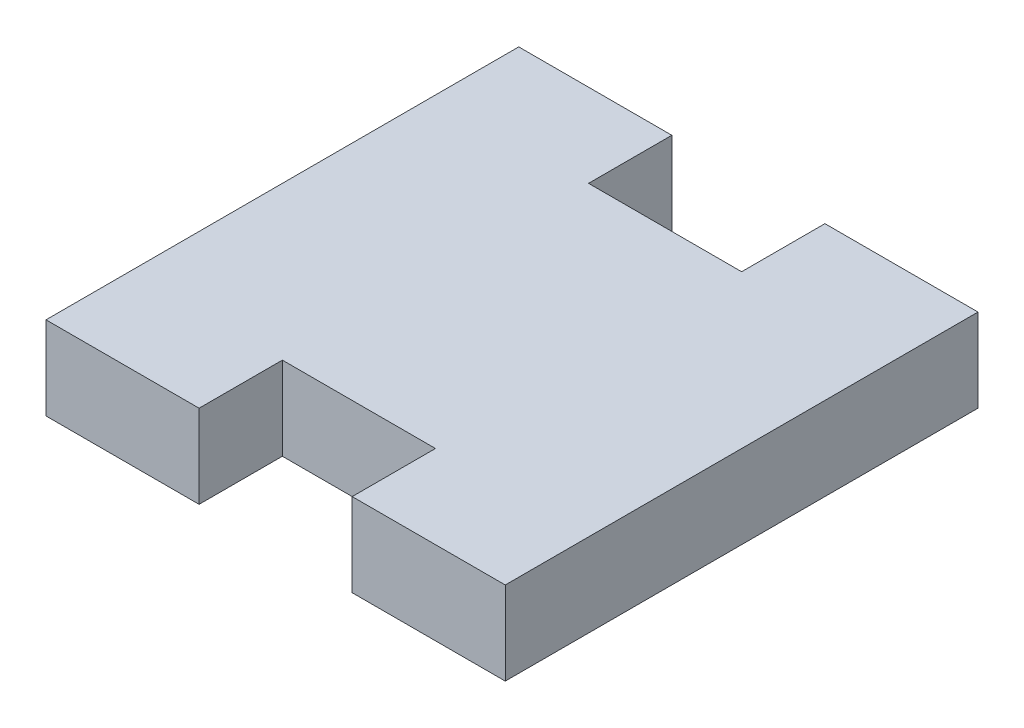
ISO-10303-21;
HEADER;
FILE_DESCRIPTION(('STEP AP214'),'2;1');
FILE_NAME('part.step','',(''),(''),'','','');
FILE_SCHEMA(('AUTOMOTIVE_DESIGN { 1 0 10303 214 1 1 1 1 }'));
ENDSEC;
DATA;
#1=APPLICATION_CONTEXT('core data for automotive mechanical design processes');
#2=APPLICATION_PROTOCOL_DEFINITION('international standard','automotive_design',2000,#1);
#3=PRODUCT_CONTEXT('',#1,'mechanical');
#4=PRODUCT('Part','Part','',(#3));
#5=PRODUCT_RELATED_PRODUCT_CATEGORY('part','',(#4));
#6=PRODUCT_DEFINITION_FORMATION('','',#4);
#7=PRODUCT_DEFINITION_CONTEXT('part definition',#1,'design');
#8=PRODUCT_DEFINITION('design','',#6,#7);
#9=PRODUCT_DEFINITION_SHAPE('','',#8);
#10=(LENGTH_UNIT() NAMED_UNIT(*) SI_UNIT(.MILLI.,.METRE.));
#11=(NAMED_UNIT(*) PLANE_ANGLE_UNIT() SI_UNIT($,.RADIAN.));
#12=(NAMED_UNIT(*) SI_UNIT($,.STERADIAN.) SOLID_ANGLE_UNIT());
#13=UNCERTAINTY_MEASURE_WITH_UNIT(LENGTH_MEASURE(1.E-05),#10,'distance_accuracy_value','');
#14=(GEOMETRIC_REPRESENTATION_CONTEXT(3) GLOBAL_UNCERTAINTY_ASSIGNED_CONTEXT((#13)) GLOBAL_UNIT_ASSIGNED_CONTEXT((#10,
#11,#12)) REPRESENTATION_CONTEXT('',''));
#15=CARTESIAN_POINT('',(0.,0.,0.));
#16=DIRECTION('',(0.,0.,1.));
#17=DIRECTION('',(1.,0.,0.));
#18=AXIS2_PLACEMENT_3D('',#15,#16,#17);
#19=CARTESIAN_POINT('',(0.,5.44,-30.88));
#20=DIRECTION('',(0.,-1.,0.));
#21=DIRECTION('',(0.,0.,-1.));
#22=AXIS2_PLACEMENT_3D('',#19,#20,#21);
#23=PLANE('',#22);
#24=DIRECTION('',(0.,0.,-1.));
#25=VECTOR('',#24,1.);
#26=CARTESIAN_POINT('',(20.,5.44,0.));
#27=LINE('',#26,#25);
#28=CARTESIAN_POINT('',(20.,5.44,0.));
#29=VERTEX_POINT('',#28);
#30=CARTESIAN_POINT('',(20.,5.44,-5.44));
#31=VERTEX_POINT('',#30);
#32=EDGE_CURVE('E132',#29,#31,#27,.T.);
#33=ORIENTED_EDGE('',*,*,#32,.F.);
#34=DIRECTION('',(1.,0.,0.));
#35=VECTOR('',#34,1.);
#36=CARTESIAN_POINT('',(0.,5.44,0.));
#37=LINE('',#36,#35);
#38=CARTESIAN_POINT('',(30.,5.44,0.));
#39=VERTEX_POINT('',#38);
#40=EDGE_CURVE('E140',#29,#39,#37,.T.);
#41=ORIENTED_EDGE('',*,*,#40,.T.);
#42=DIRECTION('',(0.,0.,-1.));
#43=VECTOR('',#42,1.);
#44=CARTESIAN_POINT('',(30.,5.44,0.));
#45=LINE('',#44,#43);
#46=CARTESIAN_POINT('',(30.,5.44,-30.88));
#47=VERTEX_POINT('',#46);
#48=EDGE_CURVE('E200',#39,#47,#45,.T.);
#49=ORIENTED_EDGE('',*,*,#48,.T.);
#50=DIRECTION('',(-1.,0.,0.));
#51=VECTOR('',#50,1.);
#52=CARTESIAN_POINT('',(0.,5.44,-30.88));
#53=LINE('',#52,#51);
#54=CARTESIAN_POINT('',(20.,5.44,-30.88));
#55=VERTEX_POINT('',#54);
#56=EDGE_CURVE('E166',#47,#55,#53,.T.);
#57=ORIENTED_EDGE('',*,*,#56,.T.);
#58=DIRECTION('',(0.,0.,1.));
#59=VECTOR('',#58,1.);
#60=CARTESIAN_POINT('',(20.,5.44,-30.88));
#61=LINE('',#60,#59);
#62=CARTESIAN_POINT('',(20.,5.44,-25.44));
#63=VERTEX_POINT('',#62);
#64=EDGE_CURVE('E191',#55,#63,#61,.T.);
#65=ORIENTED_EDGE('',*,*,#64,.T.);
#66=DIRECTION('',(1.,0.,0.));
#67=VECTOR('',#66,1.);
#68=CARTESIAN_POINT('',(9.99999999999999,5.44,-25.44));
#69=LINE('',#68,#67);
#70=CARTESIAN_POINT('',(9.99999999999999,5.44,-25.44));
#71=VERTEX_POINT('',#70);
#72=EDGE_CURVE('E186',#71,#63,#69,.T.);
#73=ORIENTED_EDGE('',*,*,#72,.F.);
#74=DIRECTION('',(0.,0.,1.));
#75=VECTOR('',#74,1.);
#76=CARTESIAN_POINT('',(9.99999999999999,5.44,-30.88));
#77=LINE('',#76,#75);
#78=CARTESIAN_POINT('',(9.99999999999999,5.44,-30.88));
#79=VERTEX_POINT('',#78);
#80=EDGE_CURVE('E184',#79,#71,#77,.T.);
#81=ORIENTED_EDGE('',*,*,#80,.F.);
#82=CARTESIAN_POINT('',(0.,5.44,-30.88));
#83=VERTEX_POINT('',#82);
#84=EDGE_CURVE('E201',#79,#83,#53,.T.);
#85=ORIENTED_EDGE('',*,*,#84,.T.);
#86=DIRECTION('',(0.,0.,1.));
#87=VECTOR('',#86,1.);
#88=CARTESIAN_POINT('',(0.,5.44,0.));
#89=LINE('',#88,#87);
#90=CARTESIAN_POINT('',(0.,5.44,0.));
#91=VERTEX_POINT('',#90);
#92=EDGE_CURVE('E161',#83,#91,#89,.T.);
#93=ORIENTED_EDGE('',*,*,#92,.T.);
#94=CARTESIAN_POINT('',(10.,5.44,0.));
#95=VERTEX_POINT('',#94);
#96=EDGE_CURVE('E197',#91,#95,#37,.T.);
#97=ORIENTED_EDGE('',*,*,#96,.T.);
#98=DIRECTION('',(0.,0.,-1.));
#99=VECTOR('',#98,1.);
#100=CARTESIAN_POINT('',(10.,5.44,0.));
#101=LINE('',#100,#99);
#102=CARTESIAN_POINT('',(10.,5.44,-5.44));
#103=VERTEX_POINT('',#102);
#104=EDGE_CURVE('E219',#95,#103,#101,.T.);
#105=ORIENTED_EDGE('',*,*,#104,.T.);
#106=DIRECTION('',(-1.,0.,0.));
#107=VECTOR('',#106,1.);
#108=CARTESIAN_POINT('',(10.,5.44,-5.44));
#109=LINE('',#108,#107);
#110=EDGE_CURVE('E220',#31,#103,#109,.T.);
#111=ORIENTED_EDGE('',*,*,#110,.F.);
#112=EDGE_LOOP('',(#33,#41,#49,#57,#65,#73,#81,#85,#93,#97,#105,#111));
#113=FACE_BOUND('',#112,.T.);
#114=ADVANCED_FACE('F31',(#113),#23,.F.);
#115=CARTESIAN_POINT('',(0.,5.44,0.));
#116=DIRECTION('',(0.,0.,-1.));
#117=DIRECTION('',(-1.,0.,0.));
#118=AXIS2_PLACEMENT_3D('',#115,#116,#117);
#119=PLANE('',#118);
#120=DIRECTION('',(0.,1.,0.));
#121=VECTOR('',#120,1.);
#122=CARTESIAN_POINT('',(20.,5.44,0.));
#123=LINE('',#122,#121);
#124=CARTESIAN_POINT('',(20.,0.,0.));
#125=VERTEX_POINT('',#124);
#126=EDGE_CURVE('E125',#125,#29,#123,.T.);
#127=ORIENTED_EDGE('',*,*,#126,.F.);
#128=DIRECTION('',(1.,0.,0.));
#129=VECTOR('',#128,1.);
#130=CARTESIAN_POINT('',(0.,0.,0.));
#131=LINE('',#130,#129);
#132=CARTESIAN_POINT('',(30.,0.,0.));
#133=VERTEX_POINT('',#132);
#134=EDGE_CURVE('E138',#125,#133,#131,.T.);
#135=ORIENTED_EDGE('',*,*,#134,.T.);
#136=DIRECTION('',(0.,-1.,0.));
#137=VECTOR('',#136,1.);
#138=CARTESIAN_POINT('',(30.,5.44,0.));
#139=LINE('',#138,#137);
#140=EDGE_CURVE('E169',#39,#133,#139,.T.);
#141=ORIENTED_EDGE('',*,*,#140,.F.);
#142=ORIENTED_EDGE('',*,*,#40,.F.);
#143=EDGE_LOOP('',(#127,#135,#141,#142));
#144=FACE_BOUND('',#143,.T.);
#145=ADVANCED_FACE('F136',(#144),#119,.F.);
#146=DIRECTION('',(0.,-1.,0.));
#147=VECTOR('',#146,1.);
#148=CARTESIAN_POINT('',(10.,5.44,0.));
#149=LINE('',#148,#147);
#150=CARTESIAN_POINT('',(10.,0.,0.));
#151=VERTEX_POINT('',#150);
#152=EDGE_CURVE('E141',#95,#151,#149,.T.);
#153=ORIENTED_EDGE('',*,*,#152,.F.);
#154=ORIENTED_EDGE('',*,*,#96,.F.);
#155=DIRECTION('',(0.,-1.,0.));
#156=VECTOR('',#155,1.);
#157=CARTESIAN_POINT('',(0.,5.44,0.));
#158=LINE('',#157,#156);
#159=CARTESIAN_POINT('',(0.,0.,0.));
#160=VERTEX_POINT('',#159);
#161=EDGE_CURVE('E171',#91,#160,#158,.T.);
#162=ORIENTED_EDGE('',*,*,#161,.T.);
#163=EDGE_CURVE('E148',#160,#151,#131,.T.);
#164=ORIENTED_EDGE('',*,*,#163,.T.);
#165=EDGE_LOOP('',(#153,#154,#162,#164));
#166=FACE_BOUND('',#165,.T.);
#167=ADVANCED_FACE('F216',(#166),#119,.F.);
#168=CARTESIAN_POINT('',(0.,5.44,-30.88));
#169=DIRECTION('',(0.,0.,1.));
#170=DIRECTION('',(1.,0.,0.));
#171=AXIS2_PLACEMENT_3D('',#168,#169,#170);
#172=PLANE('',#171);
#173=DIRECTION('',(0.,1.,0.));
#174=VECTOR('',#173,1.);
#175=CARTESIAN_POINT('',(9.99999999999999,0.,-30.88));
#176=LINE('',#175,#174);
#177=CARTESIAN_POINT('',(9.99999999999999,0.,-30.88));
#178=VERTEX_POINT('',#177);
#179=EDGE_CURVE('E226',#178,#79,#176,.T.);
#180=ORIENTED_EDGE('',*,*,#179,.F.);
#181=DIRECTION('',(-1.,0.,0.));
#182=VECTOR('',#181,1.);
#183=CARTESIAN_POINT('',(0.,0.,-30.88));
#184=LINE('',#183,#182);
#185=CARTESIAN_POINT('',(0.,0.,-30.88));
#186=VERTEX_POINT('',#185);
#187=EDGE_CURVE('E157',#178,#186,#184,.T.);
#188=ORIENTED_EDGE('',*,*,#187,.T.);
#189=DIRECTION('',(0.,-1.,0.));
#190=VECTOR('',#189,1.);
#191=CARTESIAN_POINT('',(0.,5.44,-30.88));
#192=LINE('',#191,#190);
#193=EDGE_CURVE('E162',#83,#186,#192,.T.);
#194=ORIENTED_EDGE('',*,*,#193,.F.);
#195=ORIENTED_EDGE('',*,*,#84,.F.);
#196=EDGE_LOOP('',(#180,#188,#194,#195));
#197=FACE_BOUND('',#196,.T.);
#198=ADVANCED_FACE('F211',(#197),#172,.F.);
#199=DIRECTION('',(0.,-1.,0.));
#200=VECTOR('',#199,1.);
#201=CARTESIAN_POINT('',(20.,0.,-30.88));
#202=LINE('',#201,#200);
#203=CARTESIAN_POINT('',(20.,0.,-30.88));
#204=VERTEX_POINT('',#203);
#205=EDGE_CURVE('E228',#55,#204,#202,.T.);
#206=ORIENTED_EDGE('',*,*,#205,.F.);
#207=ORIENTED_EDGE('',*,*,#56,.F.);
#208=DIRECTION('',(0.,-1.,0.));
#209=VECTOR('',#208,1.);
#210=CARTESIAN_POINT('',(30.,5.44,-30.88));
#211=LINE('',#210,#209);
#212=CARTESIAN_POINT('',(30.,0.,-30.88));
#213=VERTEX_POINT('',#212);
#214=EDGE_CURVE('E165',#47,#213,#211,.T.);
#215=ORIENTED_EDGE('',*,*,#214,.T.);
#216=EDGE_CURVE('E158',#213,#204,#184,.T.);
#217=ORIENTED_EDGE('',*,*,#216,.T.);
#218=EDGE_LOOP('',(#206,#207,#215,#217));
#219=FACE_BOUND('',#218,.T.);
#220=ADVANCED_FACE('F235',(#219),#172,.F.);
#221=CARTESIAN_POINT('',(0.,5.44,0.));
#222=DIRECTION('',(1.,0.,0.));
#223=DIRECTION('',(0.,0.,-1.));
#224=AXIS2_PLACEMENT_3D('',#221,#222,#223);
#225=PLANE('',#224);
#226=DIRECTION('',(0.,0.,1.));
#227=VECTOR('',#226,1.);
#228=CARTESIAN_POINT('',(0.,0.,0.));
#229=LINE('',#228,#227);
#230=EDGE_CURVE('E149',#186,#160,#229,.T.);
#231=ORIENTED_EDGE('',*,*,#230,.T.);
#232=ORIENTED_EDGE('',*,*,#161,.F.);
#233=ORIENTED_EDGE('',*,*,#92,.F.);
#234=ORIENTED_EDGE('',*,*,#193,.T.);
#235=EDGE_LOOP('',(#231,#232,#233,#234));
#236=FACE_BOUND('',#235,.T.);
#237=ADVANCED_FACE('F33',(#236),#225,.F.);
#238=CARTESIAN_POINT('',(30.,5.44,0.));
#239=DIRECTION('',(-1.,0.,0.));
#240=DIRECTION('',(0.,0.,1.));
#241=AXIS2_PLACEMENT_3D('',#238,#239,#240);
#242=PLANE('',#241);
#243=DIRECTION('',(0.,0.,-1.));
#244=VECTOR('',#243,1.);
#245=CARTESIAN_POINT('',(30.,0.,0.));
#246=LINE('',#245,#244);
#247=EDGE_CURVE('E147',#133,#213,#246,.T.);
#248=ORIENTED_EDGE('',*,*,#247,.T.);
#249=ORIENTED_EDGE('',*,*,#214,.F.);
#250=ORIENTED_EDGE('',*,*,#48,.F.);
#251=ORIENTED_EDGE('',*,*,#140,.T.);
#252=EDGE_LOOP('',(#248,#249,#250,#251));
#253=FACE_BOUND('',#252,.T.);
#254=ADVANCED_FACE('F239',(#253),#242,.F.);
#255=CARTESIAN_POINT('',(0.,0.,-30.88));
#256=DIRECTION('',(0.,-1.,0.));
#257=DIRECTION('',(0.,0.,-1.));
#258=AXIS2_PLACEMENT_3D('',#255,#256,#257);
#259=PLANE('',#258);
#260=DIRECTION('',(1.,0.,0.));
#261=VECTOR('',#260,1.);
#262=CARTESIAN_POINT('',(0.,0.,-5.44));
#263=LINE('',#262,#261);
#264=CARTESIAN_POINT('',(10.,0.,-5.44));
#265=VERTEX_POINT('',#264);
#266=CARTESIAN_POINT('',(20.,0.,-5.44));
#267=VERTEX_POINT('',#266);
#268=EDGE_CURVE('E11',#265,#267,#263,.T.);
#269=ORIENTED_EDGE('',*,*,#268,.F.);
#270=DIRECTION('',(0.,0.,-1.));
#271=VECTOR('',#270,1.);
#272=CARTESIAN_POINT('',(10.,0.,0.));
#273=LINE('',#272,#271);
#274=EDGE_CURVE('E46',#151,#265,#273,.T.);
#275=ORIENTED_EDGE('',*,*,#274,.F.);
#276=ORIENTED_EDGE('',*,*,#163,.F.);
#277=ORIENTED_EDGE('',*,*,#230,.F.);
#278=ORIENTED_EDGE('',*,*,#187,.F.);
#279=DIRECTION('',(0.,0.,1.));
#280=VECTOR('',#279,1.);
#281=CARTESIAN_POINT('',(9.99999999999999,0.,-30.88));
#282=LINE('',#281,#280);
#283=CARTESIAN_POINT('',(9.99999999999999,0.,-25.44));
#284=VERTEX_POINT('',#283);
#285=EDGE_CURVE('E152',#178,#284,#282,.T.);
#286=ORIENTED_EDGE('',*,*,#285,.T.);
#287=DIRECTION('',(-1.,0.,0.));
#288=VECTOR('',#287,1.);
#289=CARTESIAN_POINT('',(0.,0.,-25.44));
#290=LINE('',#289,#288);
#291=CARTESIAN_POINT('',(20.,0.,-25.44));
#292=VERTEX_POINT('',#291);
#293=EDGE_CURVE('E39',#292,#284,#290,.T.);
#294=ORIENTED_EDGE('',*,*,#293,.F.);
#295=DIRECTION('',(0.,0.,1.));
#296=VECTOR('',#295,1.);
#297=CARTESIAN_POINT('',(20.,0.,-30.88));
#298=LINE('',#297,#296);
#299=EDGE_CURVE('E54',#204,#292,#298,.T.);
#300=ORIENTED_EDGE('',*,*,#299,.F.);
#301=ORIENTED_EDGE('',*,*,#216,.F.);
#302=ORIENTED_EDGE('',*,*,#247,.F.);
#303=ORIENTED_EDGE('',*,*,#134,.F.);
#304=DIRECTION('',(0.,0.,-1.));
#305=VECTOR('',#304,1.);
#306=CARTESIAN_POINT('',(20.,0.,0.));
#307=LINE('',#306,#305);
#308=EDGE_CURVE('E121',#125,#267,#307,.T.);
#309=ORIENTED_EDGE('',*,*,#308,.T.);
#310=EDGE_LOOP('',(#269,#275,#276,#277,#278,#286,#294,#300,#301,#302,#303,#309));
#311=FACE_BOUND('',#310,.T.);
#312=ADVANCED_FACE('F145',(#311),#259,.T.);
#313=CARTESIAN_POINT('',(9.99999999999999,0.,-30.88));
#314=DIRECTION('',(1.,0.,0.));
#315=DIRECTION('',(0.,0.,1.));
#316=AXIS2_PLACEMENT_3D('',#313,#314,#315);
#317=PLANE('',#316);
#318=DIRECTION('',(0.,1.,0.));
#319=VECTOR('',#318,1.);
#320=CARTESIAN_POINT('',(9.99999999999999,0.,-25.44));
#321=LINE('',#320,#319);
#322=EDGE_CURVE('E131',#284,#71,#321,.T.);
#323=ORIENTED_EDGE('',*,*,#322,.F.);
#324=ORIENTED_EDGE('',*,*,#285,.F.);
#325=ORIENTED_EDGE('',*,*,#179,.T.);
#326=ORIENTED_EDGE('',*,*,#80,.T.);
#327=EDGE_LOOP('',(#323,#324,#325,#326));
#328=FACE_BOUND('',#327,.T.);
#329=ADVANCED_FACE('F181',(#328),#317,.T.);
#330=CARTESIAN_POINT('',(20.,0.,-30.88));
#331=DIRECTION('',(-1.,0.,0.));
#332=DIRECTION('',(0.,0.,-1.));
#333=AXIS2_PLACEMENT_3D('',#330,#331,#332);
#334=PLANE('',#333);
#335=DIRECTION('',(0.,-1.,0.));
#336=VECTOR('',#335,1.);
#337=CARTESIAN_POINT('',(20.,0.,-25.44));
#338=LINE('',#337,#336);
#339=EDGE_CURVE('E178',#63,#292,#338,.T.);
#340=ORIENTED_EDGE('',*,*,#339,.F.);
#341=ORIENTED_EDGE('',*,*,#64,.F.);
#342=ORIENTED_EDGE('',*,*,#205,.T.);
#343=ORIENTED_EDGE('',*,*,#299,.T.);
#344=EDGE_LOOP('',(#340,#341,#342,#343));
#345=FACE_BOUND('',#344,.T.);
#346=ADVANCED_FACE('F233',(#345),#334,.T.);
#347=CARTESIAN_POINT('',(0.,-25.,-25.44));
#348=DIRECTION('',(0.,0.,1.));
#349=DIRECTION('',(-1.,0.,0.));
#350=AXIS2_PLACEMENT_3D('',#347,#348,#349);
#351=PLANE('',#350);
#352=ORIENTED_EDGE('',*,*,#293,.T.);
#353=ORIENTED_EDGE('',*,*,#322,.T.);
#354=ORIENTED_EDGE('',*,*,#72,.T.);
#355=ORIENTED_EDGE('',*,*,#339,.T.);
#356=EDGE_LOOP('',(#352,#353,#354,#355));
#357=FACE_BOUND('',#356,.T.);
#358=ADVANCED_FACE('F176',(#357),#351,.F.);
#359=CARTESIAN_POINT('',(20.,5.44,0.));
#360=DIRECTION('',(-1.,0.,0.));
#361=DIRECTION('',(0.,0.,1.));
#362=AXIS2_PLACEMENT_3D('',#359,#360,#361);
#363=PLANE('',#362);
#364=DIRECTION('',(0.,1.,0.));
#365=VECTOR('',#364,1.);
#366=CARTESIAN_POINT('',(20.,5.44,-5.44));
#367=LINE('',#366,#365);
#368=EDGE_CURVE('E127',#267,#31,#367,.T.);
#369=ORIENTED_EDGE('',*,*,#368,.F.);
#370=ORIENTED_EDGE('',*,*,#308,.F.);
#371=ORIENTED_EDGE('',*,*,#126,.T.);
#372=ORIENTED_EDGE('',*,*,#32,.T.);
#373=EDGE_LOOP('',(#369,#370,#371,#372));
#374=FACE_BOUND('',#373,.T.);
#375=ADVANCED_FACE('F123',(#374),#363,.T.);
#376=CARTESIAN_POINT('',(10.,5.44,0.));
#377=DIRECTION('',(1.,0.,0.));
#378=DIRECTION('',(0.,1.,0.));
#379=AXIS2_PLACEMENT_3D('',#376,#377,#378);
#380=PLANE('',#379);
#381=DIRECTION('',(0.,-1.,0.));
#382=VECTOR('',#381,1.);
#383=CARTESIAN_POINT('',(10.,5.44,-5.44));
#384=LINE('',#383,#382);
#385=EDGE_CURVE('E142',#103,#265,#384,.T.);
#386=ORIENTED_EDGE('',*,*,#385,.F.);
#387=ORIENTED_EDGE('',*,*,#104,.F.);
#388=ORIENTED_EDGE('',*,*,#152,.T.);
#389=ORIENTED_EDGE('',*,*,#274,.T.);
#390=EDGE_LOOP('',(#386,#387,#388,#389));
#391=FACE_BOUND('',#390,.T.);
#392=ADVANCED_FACE('F300',(#391),#380,.T.);
#393=CARTESIAN_POINT('',(0.,0.,-5.44));
#394=DIRECTION('',(0.,0.,-1.));
#395=DIRECTION('',(-1.,0.,0.));
#396=AXIS2_PLACEMENT_3D('',#393,#394,#395);
#397=PLANE('',#396);
#398=ORIENTED_EDGE('',*,*,#268,.T.);
#399=ORIENTED_EDGE('',*,*,#368,.T.);
#400=ORIENTED_EDGE('',*,*,#110,.T.);
#401=ORIENTED_EDGE('',*,*,#385,.T.);
#402=EDGE_LOOP('',(#398,#399,#400,#401));
#403=FACE_BOUND('',#402,.T.);
#404=ADVANCED_FACE('F308',(#403),#397,.F.);
#405=CLOSED_SHELL('',(#114,#145,#167,#198,#220,#237,#254,#312,#329,#346,#358,#375,#392,#404));
#406=MANIFOLD_SOLID_BREP('B2',#405);
#407=ADVANCED_BREP_SHAPE_REPRESENTATION('',(#18,#406),#14);
#408=SHAPE_DEFINITION_REPRESENTATION(#9,#407);
ENDSEC;
END-ISO-10303-21;
